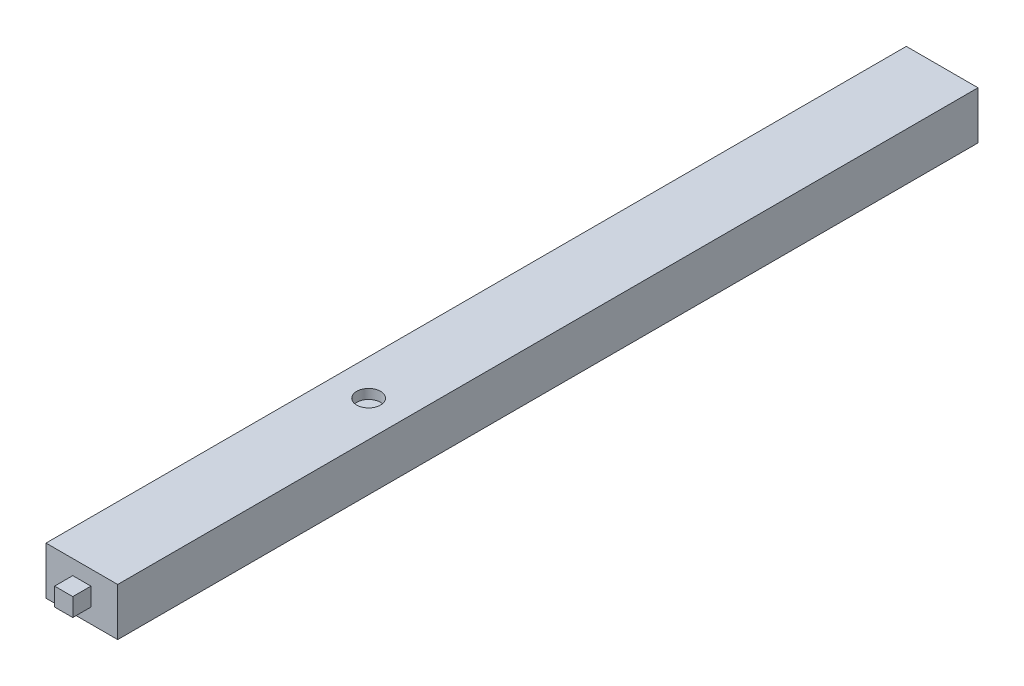
ISO-10303-21;
HEADER;
FILE_DESCRIPTION(('STEP AP214'),'2;1');
FILE_NAME('part.step','',(''),(''),'','','');
FILE_SCHEMA(('AUTOMOTIVE_DESIGN { 1 0 10303 214 1 1 1 1 }'));
ENDSEC;
DATA;
#1=APPLICATION_CONTEXT('core data for automotive mechanical design processes');
#2=APPLICATION_PROTOCOL_DEFINITION('international standard','automotive_design',2000,#1);
#3=PRODUCT_CONTEXT('',#1,'mechanical');
#4=PRODUCT('Part','Part','',(#3));
#5=PRODUCT_RELATED_PRODUCT_CATEGORY('part','',(#4));
#6=PRODUCT_DEFINITION_FORMATION('','',#4);
#7=PRODUCT_DEFINITION_CONTEXT('part definition',#1,'design');
#8=PRODUCT_DEFINITION('design','',#6,#7);
#9=PRODUCT_DEFINITION_SHAPE('','',#8);
#10=(LENGTH_UNIT() NAMED_UNIT(*) SI_UNIT(.MILLI.,.METRE.));
#11=(NAMED_UNIT(*) PLANE_ANGLE_UNIT() SI_UNIT($,.RADIAN.));
#12=(NAMED_UNIT(*) SI_UNIT($,.STERADIAN.) SOLID_ANGLE_UNIT());
#13=UNCERTAINTY_MEASURE_WITH_UNIT(LENGTH_MEASURE(1.E-05),#10,'distance_accuracy_value','');
#14=(GEOMETRIC_REPRESENTATION_CONTEXT(3) GLOBAL_UNCERTAINTY_ASSIGNED_CONTEXT((#13)) GLOBAL_UNIT_ASSIGNED_CONTEXT((#10,
#11,#12)) REPRESENTATION_CONTEXT('',''));
#15=CARTESIAN_POINT('',(0.,0.,0.));
#16=DIRECTION('',(0.,0.,1.));
#17=DIRECTION('',(1.,0.,0.));
#18=AXIS2_PLACEMENT_3D('',#15,#16,#17);
#19=CARTESIAN_POINT('',(0.,0.,180.));
#20=DIRECTION('',(0.,0.,-1.));
#21=DIRECTION('',(-1.,0.,0.));
#22=AXIS2_PLACEMENT_3D('',#19,#20,#21);
#23=PLANE('',#22);
#24=DIRECTION('',(0.,1.,0.));
#25=VECTOR('',#24,1.);
#26=CARTESIAN_POINT('',(7.5,-5.,180.));
#27=LINE('',#26,#25);
#28=CARTESIAN_POINT('',(7.5,-5.,180.));
#29=VERTEX_POINT('',#28);
#30=CARTESIAN_POINT('',(7.5,5.,180.));
#31=VERTEX_POINT('',#30);
#32=EDGE_CURVE('E127',#29,#31,#27,.T.);
#33=ORIENTED_EDGE('',*,*,#32,.T.);
#34=DIRECTION('',(-1.,0.,0.));
#35=VECTOR('',#34,1.);
#36=CARTESIAN_POINT('',(-7.5,5.,180.));
#37=LINE('',#36,#35);
#38=CARTESIAN_POINT('',(-7.5,5.,180.));
#39=VERTEX_POINT('',#38);
#40=EDGE_CURVE('E130',#31,#39,#37,.T.);
#41=ORIENTED_EDGE('',*,*,#40,.T.);
#42=DIRECTION('',(0.,-1.,0.));
#43=VECTOR('',#42,1.);
#44=CARTESIAN_POINT('',(-7.5,-5.,180.));
#45=LINE('',#44,#43);
#46=CARTESIAN_POINT('',(-7.5,-5.,180.));
#47=VERTEX_POINT('',#46);
#48=EDGE_CURVE('E133',#39,#47,#45,.T.);
#49=ORIENTED_EDGE('',*,*,#48,.T.);
#50=DIRECTION('',(1.,0.,0.));
#51=VECTOR('',#50,1.);
#52=CARTESIAN_POINT('',(-7.5,-5.,180.));
#53=LINE('',#52,#51);
#54=EDGE_CURVE('E135',#47,#29,#53,.T.);
#55=ORIENTED_EDGE('',*,*,#54,.T.);
#56=EDGE_LOOP('',(#33,#41,#49,#55));
#57=FACE_BOUND('',#56,.T.);
#58=DIRECTION('',(0.,1.,0.));
#59=VECTOR('',#58,1.);
#60=CARTESIAN_POINT('',(1.9,-1.9,180.));
#61=LINE('',#60,#59);
#62=CARTESIAN_POINT('',(1.9,-1.9,180.));
#63=VERTEX_POINT('',#62);
#64=CARTESIAN_POINT('',(1.9,1.9,180.));
#65=VERTEX_POINT('',#64);
#66=EDGE_CURVE('E48',#63,#65,#61,.T.);
#67=ORIENTED_EDGE('',*,*,#66,.F.);
#68=DIRECTION('',(1.,0.,0.));
#69=VECTOR('',#68,1.);
#70=CARTESIAN_POINT('',(-1.9,-1.9,180.));
#71=LINE('',#70,#69);
#72=CARTESIAN_POINT('',(-1.9,-1.9,180.));
#73=VERTEX_POINT('',#72);
#74=EDGE_CURVE('E52',#73,#63,#71,.T.);
#75=ORIENTED_EDGE('',*,*,#74,.F.);
#76=DIRECTION('',(0.,-1.,0.));
#77=VECTOR('',#76,1.);
#78=CARTESIAN_POINT('',(-1.9,-1.9,180.));
#79=LINE('',#78,#77);
#80=CARTESIAN_POINT('',(-1.9,1.9,180.));
#81=VERTEX_POINT('',#80);
#82=EDGE_CURVE('E293',#81,#73,#79,.T.);
#83=ORIENTED_EDGE('',*,*,#82,.F.);
#84=DIRECTION('',(-1.,0.,0.));
#85=VECTOR('',#84,1.);
#86=CARTESIAN_POINT('',(-1.9,1.9,180.));
#87=LINE('',#86,#85);
#88=EDGE_CURVE('E284',#65,#81,#87,.T.);
#89=ORIENTED_EDGE('',*,*,#88,.F.);
#90=EDGE_LOOP('',(#67,#75,#83,#89));
#91=FACE_BOUND('',#90,.T.);
#92=ADVANCED_FACE('F33',(#57,#91),#23,.F.);
#93=CARTESIAN_POINT('',(7.5,-5.,180.));
#94=DIRECTION('',(-1.,0.,0.));
#95=DIRECTION('',(0.,0.,1.));
#96=AXIS2_PLACEMENT_3D('',#93,#94,#95);
#97=PLANE('',#96);
#98=DIRECTION('',(0.,1.,0.));
#99=VECTOR('',#98,1.);
#100=CARTESIAN_POINT('',(7.5,-5.,0.));
#101=LINE('',#100,#99);
#102=CARTESIAN_POINT('',(7.5,-5.,0.));
#103=VERTEX_POINT('',#102);
#104=CARTESIAN_POINT('',(7.5,5.,0.));
#105=VERTEX_POINT('',#104);
#106=EDGE_CURVE('E118',#103,#105,#101,.T.);
#107=ORIENTED_EDGE('',*,*,#106,.T.);
#108=DIRECTION('',(0.,0.,-1.));
#109=VECTOR('',#108,1.);
#110=CARTESIAN_POINT('',(7.5,5.,180.));
#111=LINE('',#110,#109);
#112=EDGE_CURVE('E11',#31,#105,#111,.T.);
#113=ORIENTED_EDGE('',*,*,#112,.F.);
#114=ORIENTED_EDGE('',*,*,#32,.F.);
#115=DIRECTION('',(0.,0.,-1.));
#116=VECTOR('',#115,1.);
#117=CARTESIAN_POINT('',(7.5,-5.,180.));
#118=LINE('',#117,#116);
#119=EDGE_CURVE('E136',#29,#103,#118,.T.);
#120=ORIENTED_EDGE('',*,*,#119,.T.);
#121=EDGE_LOOP('',(#107,#113,#114,#120));
#122=FACE_BOUND('',#121,.T.);
#123=ADVANCED_FACE('F35',(#122),#97,.F.);
#124=CARTESIAN_POINT('',(-7.5,5.,180.));
#125=DIRECTION('',(0.,-1.,0.));
#126=DIRECTION('',(0.,0.,-1.));
#127=AXIS2_PLACEMENT_3D('',#124,#125,#126);
#128=PLANE('',#127);
#129=CARTESIAN_POINT('',(0.,5.,120.));
#130=DIRECTION('',(0.,1.,0.));
#131=DIRECTION('',(0.,0.,1.));
#132=AXIS2_PLACEMENT_3D('',#129,#130,#131);
#133=CIRCLE('',#132,2.5);
#134=CARTESIAN_POINT('',(0.,5.,122.5));
#135=VERTEX_POINT('',#134);
#136=EDGE_CURVE('E282',#135,#135,#133,.T.);
#137=ORIENTED_EDGE('',*,*,#136,.F.);
#138=EDGE_LOOP('',(#137));
#139=FACE_BOUND('',#138,.T.);
#140=DIRECTION('',(-1.,0.,0.));
#141=VECTOR('',#140,1.);
#142=CARTESIAN_POINT('',(-7.5,5.,0.));
#143=LINE('',#142,#141);
#144=CARTESIAN_POINT('',(-7.5,5.,0.));
#145=VERTEX_POINT('',#144);
#146=EDGE_CURVE('E121',#105,#145,#143,.T.);
#147=ORIENTED_EDGE('',*,*,#146,.T.);
#148=DIRECTION('',(0.,0.,-1.));
#149=VECTOR('',#148,1.);
#150=CARTESIAN_POINT('',(-7.5,5.,180.));
#151=LINE('',#150,#149);
#152=EDGE_CURVE('E41',#39,#145,#151,.T.);
#153=ORIENTED_EDGE('',*,*,#152,.F.);
#154=ORIENTED_EDGE('',*,*,#40,.F.);
#155=ORIENTED_EDGE('',*,*,#112,.T.);
#156=EDGE_LOOP('',(#147,#153,#154,#155));
#157=FACE_BOUND('',#156,.T.);
#158=ADVANCED_FACE('F166',(#139,#157),#128,.F.);
#159=CARTESIAN_POINT('',(-7.5,-5.,180.));
#160=DIRECTION('',(1.,0.,0.));
#161=DIRECTION('',(0.,0.,-1.));
#162=AXIS2_PLACEMENT_3D('',#159,#160,#161);
#163=PLANE('',#162);
#164=DIRECTION('',(0.,-1.,0.));
#165=VECTOR('',#164,1.);
#166=CARTESIAN_POINT('',(-7.5,-5.,0.));
#167=LINE('',#166,#165);
#168=CARTESIAN_POINT('',(-7.5,-5.,0.));
#169=VERTEX_POINT('',#168);
#170=EDGE_CURVE('E139',#145,#169,#167,.T.);
#171=ORIENTED_EDGE('',*,*,#170,.T.);
#172=DIRECTION('',(0.,0.,-1.));
#173=VECTOR('',#172,1.);
#174=CARTESIAN_POINT('',(-7.5,-5.,180.));
#175=LINE('',#174,#173);
#176=EDGE_CURVE('E144',#47,#169,#175,.T.);
#177=ORIENTED_EDGE('',*,*,#176,.F.);
#178=ORIENTED_EDGE('',*,*,#48,.F.);
#179=ORIENTED_EDGE('',*,*,#152,.T.);
#180=EDGE_LOOP('',(#171,#177,#178,#179));
#181=FACE_BOUND('',#180,.T.);
#182=ADVANCED_FACE('F151',(#181),#163,.F.);
#183=CARTESIAN_POINT('',(-7.5,-5.,180.));
#184=DIRECTION('',(0.,1.,0.));
#185=DIRECTION('',(0.,0.,1.));
#186=AXIS2_PLACEMENT_3D('',#183,#184,#185);
#187=PLANE('',#186);
#188=DIRECTION('',(1.,0.,0.));
#189=VECTOR('',#188,1.);
#190=CARTESIAN_POINT('',(-7.5,-5.,0.));
#191=LINE('',#190,#189);
#192=EDGE_CURVE('E131',#169,#103,#191,.T.);
#193=ORIENTED_EDGE('',*,*,#192,.T.);
#194=ORIENTED_EDGE('',*,*,#119,.F.);
#195=ORIENTED_EDGE('',*,*,#54,.F.);
#196=ORIENTED_EDGE('',*,*,#176,.T.);
#197=EDGE_LOOP('',(#193,#194,#195,#196));
#198=FACE_BOUND('',#197,.T.);
#199=ADVANCED_FACE('F160',(#198),#187,.F.);
#200=CARTESIAN_POINT('',(0.,0.,0.));
#201=DIRECTION('',(0.,0.,-1.));
#202=DIRECTION('',(-1.,0.,0.));
#203=AXIS2_PLACEMENT_3D('',#200,#201,#202);
#204=PLANE('',#203);
#205=ORIENTED_EDGE('',*,*,#106,.F.);
#206=ORIENTED_EDGE('',*,*,#192,.F.);
#207=ORIENTED_EDGE('',*,*,#170,.F.);
#208=ORIENTED_EDGE('',*,*,#146,.F.);
#209=EDGE_LOOP('',(#205,#206,#207,#208));
#210=FACE_BOUND('',#209,.T.);
#211=ADVANCED_FACE('F157',(#210),#204,.T.);
#212=CARTESIAN_POINT('',(1.9,-1.9,183.8));
#213=DIRECTION('',(-1.,0.,0.));
#214=DIRECTION('',(0.,0.,1.));
#215=AXIS2_PLACEMENT_3D('',#212,#213,#214);
#216=PLANE('',#215);
#217=ORIENTED_EDGE('',*,*,#66,.T.);
#218=DIRECTION('',(0.,0.,-1.));
#219=VECTOR('',#218,1.);
#220=CARTESIAN_POINT('',(1.9,1.9,183.8));
#221=LINE('',#220,#219);
#222=CARTESIAN_POINT('',(1.9,1.9,183.8));
#223=VERTEX_POINT('',#222);
#224=EDGE_CURVE('E101',#223,#65,#221,.T.);
#225=ORIENTED_EDGE('',*,*,#224,.F.);
#226=DIRECTION('',(0.,1.,0.));
#227=VECTOR('',#226,1.);
#228=CARTESIAN_POINT('',(1.9,-1.9,183.8));
#229=LINE('',#228,#227);
#230=CARTESIAN_POINT('',(1.9,-1.9,183.8));
#231=VERTEX_POINT('',#230);
#232=EDGE_CURVE('E107',#231,#223,#229,.T.);
#233=ORIENTED_EDGE('',*,*,#232,.F.);
#234=DIRECTION('',(0.,0.,-1.));
#235=VECTOR('',#234,1.);
#236=CARTESIAN_POINT('',(1.9,-1.9,183.8));
#237=LINE('',#236,#235);
#238=EDGE_CURVE('E290',#231,#63,#237,.T.);
#239=ORIENTED_EDGE('',*,*,#238,.T.);
#240=EDGE_LOOP('',(#217,#225,#233,#239));
#241=FACE_BOUND('',#240,.T.);
#242=ADVANCED_FACE('F117',(#241),#216,.F.);
#243=CARTESIAN_POINT('',(-1.9,1.9,183.8));
#244=DIRECTION('',(0.,-1.,0.));
#245=DIRECTION('',(0.,0.,-1.));
#246=AXIS2_PLACEMENT_3D('',#243,#244,#245);
#247=PLANE('',#246);
#248=ORIENTED_EDGE('',*,*,#88,.T.);
#249=DIRECTION('',(0.,0.,-1.));
#250=VECTOR('',#249,1.);
#251=CARTESIAN_POINT('',(-1.9,1.9,183.8));
#252=LINE('',#251,#250);
#253=CARTESIAN_POINT('',(-1.9,1.9,183.8));
#254=VERTEX_POINT('',#253);
#255=EDGE_CURVE('E103',#254,#81,#252,.T.);
#256=ORIENTED_EDGE('',*,*,#255,.F.);
#257=DIRECTION('',(-1.,0.,0.));
#258=VECTOR('',#257,1.);
#259=CARTESIAN_POINT('',(-1.9,1.9,183.8));
#260=LINE('',#259,#258);
#261=EDGE_CURVE('E96',#223,#254,#260,.T.);
#262=ORIENTED_EDGE('',*,*,#261,.F.);
#263=ORIENTED_EDGE('',*,*,#224,.T.);
#264=EDGE_LOOP('',(#248,#256,#262,#263));
#265=FACE_BOUND('',#264,.T.);
#266=ADVANCED_FACE('F99',(#265),#247,.F.);
#267=CARTESIAN_POINT('',(-1.9,-1.9,183.8));
#268=DIRECTION('',(1.,0.,0.));
#269=DIRECTION('',(0.,0.,-1.));
#270=AXIS2_PLACEMENT_3D('',#267,#268,#269);
#271=PLANE('',#270);
#272=ORIENTED_EDGE('',*,*,#82,.T.);
#273=DIRECTION('',(0.,0.,-1.));
#274=VECTOR('',#273,1.);
#275=CARTESIAN_POINT('',(-1.9,-1.9,183.8));
#276=LINE('',#275,#274);
#277=CARTESIAN_POINT('',(-1.9,-1.9,183.8));
#278=VERTEX_POINT('',#277);
#279=EDGE_CURVE('E123',#278,#73,#276,.T.);
#280=ORIENTED_EDGE('',*,*,#279,.F.);
#281=DIRECTION('',(0.,-1.,0.));
#282=VECTOR('',#281,1.);
#283=CARTESIAN_POINT('',(-1.9,-1.9,183.8));
#284=LINE('',#283,#282);
#285=EDGE_CURVE('E106',#254,#278,#284,.T.);
#286=ORIENTED_EDGE('',*,*,#285,.F.);
#287=ORIENTED_EDGE('',*,*,#255,.T.);
#288=EDGE_LOOP('',(#272,#280,#286,#287));
#289=FACE_BOUND('',#288,.T.);
#290=ADVANCED_FACE('F204',(#289),#271,.F.);
#291=CARTESIAN_POINT('',(-1.9,-1.9,183.8));
#292=DIRECTION('',(0.,1.,0.));
#293=DIRECTION('',(0.,0.,1.));
#294=AXIS2_PLACEMENT_3D('',#291,#292,#293);
#295=PLANE('',#294);
#296=ORIENTED_EDGE('',*,*,#74,.T.);
#297=ORIENTED_EDGE('',*,*,#238,.F.);
#298=DIRECTION('',(1.,0.,0.));
#299=VECTOR('',#298,1.);
#300=CARTESIAN_POINT('',(-1.9,-1.9,183.8));
#301=LINE('',#300,#299);
#302=EDGE_CURVE('E112',#278,#231,#301,.T.);
#303=ORIENTED_EDGE('',*,*,#302,.F.);
#304=ORIENTED_EDGE('',*,*,#279,.T.);
#305=EDGE_LOOP('',(#296,#297,#303,#304));
#306=FACE_BOUND('',#305,.T.);
#307=ADVANCED_FACE('F210',(#306),#295,.F.);
#308=CARTESIAN_POINT('',(0.,0.,183.8));
#309=DIRECTION('',(0.,0.,-1.));
#310=DIRECTION('',(-1.,0.,0.));
#311=AXIS2_PLACEMENT_3D('',#308,#309,#310);
#312=PLANE('',#311);
#313=ORIENTED_EDGE('',*,*,#232,.T.);
#314=ORIENTED_EDGE('',*,*,#261,.T.);
#315=ORIENTED_EDGE('',*,*,#285,.T.);
#316=ORIENTED_EDGE('',*,*,#302,.T.);
#317=EDGE_LOOP('',(#313,#314,#315,#316));
#318=FACE_BOUND('',#317,.T.);
#319=ADVANCED_FACE('F110',(#318),#312,.F.);
#320=CARTESIAN_POINT('',(0.,3.,120.));
#321=DIRECTION('',(0.,1.,0.));
#322=DIRECTION('',(0.,0.,1.));
#323=AXIS2_PLACEMENT_3D('',#320,#321,#322);
#324=CYLINDRICAL_SURFACE('',#323,2.5);
#325=CARTESIAN_POINT('',(0.,3.,120.));
#326=DIRECTION('',(0.,1.,0.));
#327=DIRECTION('',(0.,0.,1.));
#328=AXIS2_PLACEMENT_3D('',#325,#326,#327);
#329=CIRCLE('',#328,2.5);
#330=CARTESIAN_POINT('',(0.,3.,122.5));
#331=VERTEX_POINT('',#330);
#332=EDGE_CURVE('E281',#331,#331,#329,.T.);
#333=ORIENTED_EDGE('',*,*,#332,.F.);
#334=EDGE_LOOP('',(#333));
#335=FACE_BOUND('',#334,.T.);
#336=ORIENTED_EDGE('',*,*,#136,.T.);
#337=EDGE_LOOP('',(#336));
#338=FACE_BOUND('',#337,.T.);
#339=ADVANCED_FACE('F225',(#335,#338),#324,.F.);
#340=CARTESIAN_POINT('',(0.,3.,120.));
#341=DIRECTION('',(0.,1.,0.));
#342=DIRECTION('',(0.,0.,1.));
#343=AXIS2_PLACEMENT_3D('',#340,#341,#342);
#344=PLANE('',#343);
#345=ORIENTED_EDGE('',*,*,#332,.T.);
#346=EDGE_LOOP('',(#345));
#347=FACE_BOUND('',#346,.T.);
#348=ADVANCED_FACE('F232',(#347),#344,.T.);
#349=CLOSED_SHELL('',(#92,#123,#158,#182,#199,#211,#242,#266,#290,#307,#319,#339,#348));
#350=MANIFOLD_SOLID_BREP('B2',#349);
#351=ADVANCED_BREP_SHAPE_REPRESENTATION('',(#18,#350),#14);
#352=SHAPE_DEFINITION_REPRESENTATION(#9,#351);
ENDSEC;
END-ISO-10303-21;
